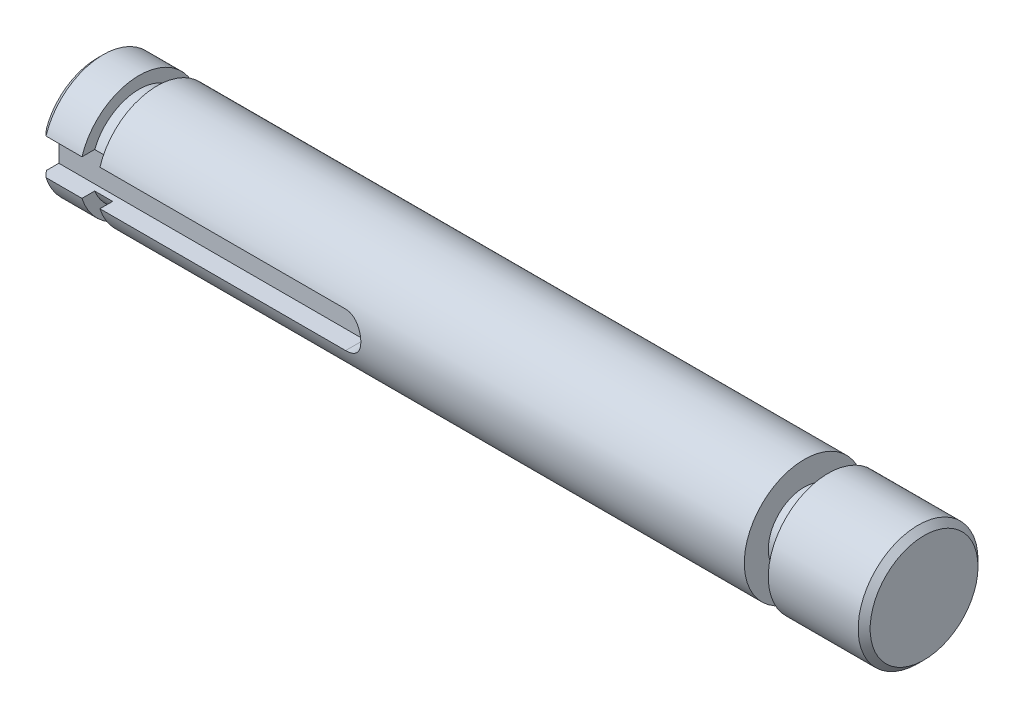
ISO-10303-21;
HEADER;
FILE_DESCRIPTION(('STEP AP214'),'2;1');
FILE_NAME('part.step','',(''),(''),'','','');
FILE_SCHEMA(('AUTOMOTIVE_DESIGN { 1 0 10303 214 1 1 1 1 }'));
ENDSEC;
DATA;
#1=APPLICATION_CONTEXT('core data for automotive mechanical design processes');
#2=APPLICATION_PROTOCOL_DEFINITION('international standard','automotive_design',2000,#1);
#3=PRODUCT_CONTEXT('',#1,'mechanical');
#4=PRODUCT('Part','Part','',(#3));
#5=PRODUCT_RELATED_PRODUCT_CATEGORY('part','',(#4));
#6=PRODUCT_DEFINITION_FORMATION('','',#4);
#7=PRODUCT_DEFINITION_CONTEXT('part definition',#1,'design');
#8=PRODUCT_DEFINITION('design','',#6,#7);
#9=PRODUCT_DEFINITION_SHAPE('','',#8);
#10=(LENGTH_UNIT() NAMED_UNIT(*) SI_UNIT(.MILLI.,.METRE.));
#11=(NAMED_UNIT(*) PLANE_ANGLE_UNIT() SI_UNIT($,.RADIAN.));
#12=(NAMED_UNIT(*) SI_UNIT($,.STERADIAN.) SOLID_ANGLE_UNIT());
#13=UNCERTAINTY_MEASURE_WITH_UNIT(LENGTH_MEASURE(1.E-05),#10,'distance_accuracy_value','');
#14=(GEOMETRIC_REPRESENTATION_CONTEXT(3) GLOBAL_UNCERTAINTY_ASSIGNED_CONTEXT((#13)) GLOBAL_UNIT_ASSIGNED_CONTEXT((#10,
#11,#12)) REPRESENTATION_CONTEXT('',''));
#15=CARTESIAN_POINT('',(0.,0.,0.));
#16=DIRECTION('',(0.,0.,1.));
#17=DIRECTION('',(1.,0.,0.));
#18=AXIS2_PLACEMENT_3D('',#15,#16,#17);
#19=CARTESIAN_POINT('',(34.5,0.,0.));
#20=DIRECTION('',(-1.,0.,0.));
#21=DIRECTION('',(0.,0.,1.));
#22=AXIS2_PLACEMENT_3D('',#19,#20,#21);
#23=CYLINDRICAL_SURFACE('',#22,5.);
#24=CARTESIAN_POINT('',(24.5,0.,0.));
#25=DIRECTION('',(1.,0.,0.));
#26=DIRECTION('',(0.,0.,-1.));
#27=AXIS2_PLACEMENT_3D('',#24,#25,#26);
#28=CIRCLE('',#27,5.);
#29=CARTESIAN_POINT('',(24.5,0.,-5.));
#30=VERTEX_POINT('',#29);
#31=EDGE_CURVE('E180',#30,#30,#28,.T.);
#32=ORIENTED_EDGE('',*,*,#31,.F.);
#33=EDGE_LOOP('',(#32));
#34=FACE_BOUND('',#33,.T.);
#35=DIRECTION('',(-1.,0.,0.));
#36=VECTOR('',#35,1.);
#37=CARTESIAN_POINT('',(34.5,-1.5,4.76969600708473));
#38=LINE('',#37,#36);
#39=CARTESIAN_POINT('',(-29.5,-1.5,4.76969600708473));
#40=VERTEX_POINT('',#39);
#41=CARTESIAN_POINT('',(-9.00000000000001,-1.5,4.76969600708473));
#42=VERTEX_POINT('',#41);
#43=EDGE_CURVE('E162',#40,#42,#38,.F.);
#44=ORIENTED_EDGE('',*,*,#43,.F.);
#45=CARTESIAN_POINT('',(-29.5,0.,0.));
#46=DIRECTION('',(-1.,0.,0.));
#47=DIRECTION('',(0.,0.,1.));
#48=AXIS2_PLACEMENT_3D('',#45,#46,#47);
#49=CIRCLE('',#48,5.);
#50=CARTESIAN_POINT('',(-29.5,1.5,4.76969600708473));
#51=VERTEX_POINT('',#50);
#52=EDGE_CURVE('E168',#51,#40,#49,.T.);
#53=ORIENTED_EDGE('',*,*,#52,.F.);
#54=DIRECTION('',(-1.,0.,0.));
#55=VECTOR('',#54,1.);
#56=CARTESIAN_POINT('',(34.5,1.5,4.76969600708473));
#57=LINE('',#56,#55);
#58=CARTESIAN_POINT('',(-9.00000000000001,1.5,4.76969600708473));
#59=VERTEX_POINT('',#58);
#60=EDGE_CURVE('E153',#59,#51,#57,.T.);
#61=ORIENTED_EDGE('',*,*,#60,.F.);
#62=CARTESIAN_POINT('',(-9.00000000000001,-1.5,4.76969600708473));
#63=CARTESIAN_POINT('',(-8.95882060709199,-1.50000085357071,4.76969249084934));
#64=CARTESIAN_POINT('',(-8.91766195687388,-1.49830317083428,4.77022997000129));
#65=CARTESIAN_POINT('',(-8.83565883790444,-1.49153785660317,4.77235095109999));
#66=CARTESIAN_POINT('',(-8.79481430060511,-1.48647098275841,4.77393421787376));
#67=CARTESIAN_POINT('',(-8.67340945904534,-1.46630203689311,4.78018490618873));
#68=CARTESIAN_POINT('',(-8.59369360958363,-1.44623120413662,4.78635370384275));
#69=CARTESIAN_POINT('',(-8.43896442161414,-1.39353102315626,4.80195952113208));
#70=CARTESIAN_POINT('',(-8.36394944780192,-1.36090607068203,4.81139539670393));
#71=CARTESIAN_POINT('',(-8.22040331840241,-1.28407841117655,4.83246571212052));
#72=CARTESIAN_POINT('',(-8.15187520027157,-1.23987031651226,4.84410117434933));
#73=CARTESIAN_POINT('',(-8.02113394400295,-1.13964850658326,4.86866835244721));
#74=CARTESIAN_POINT('',(-7.95915633965661,-1.08333433465208,4.88162755412974));
#75=CARTESIAN_POINT('',(-7.84536441610004,-0.961138919873354,4.90714811559049));
#76=CARTESIAN_POINT('',(-7.79355181399695,-0.895256063916348,4.91970940785249));
#77=CARTESIAN_POINT('',(-7.70053622968151,-0.75410992131543,4.94333239727705));
#78=CARTESIAN_POINT('',(-7.65957481970205,-0.678680819336259,4.95435770971354));
#79=CARTESIAN_POINT('',(-7.59101158838185,-0.521621185505775,4.97334469846208));
#80=CARTESIAN_POINT('',(-7.56340632220573,-0.439992259012928,4.98130716463903));
#81=CARTESIAN_POINT('',(-7.52312020089796,-0.275324697874879,4.99307639935002));
#82=CARTESIAN_POINT('',(-7.51003514203026,-0.192393125294255,4.99699549276993));
#83=CARTESIAN_POINT('',(-7.49788265863674,-0.0254235719980831,5.00063202022426));
#84=CARTESIAN_POINT('',(-7.49881258029984,0.0586141962423611,5.00035024971471));
#85=CARTESIAN_POINT('',(-7.514392908759,0.222571599946016,4.99569602566267));
#86=CARTESIAN_POINT('',(-7.52860534497872,0.30253714546464,4.99145415509187));
#87=CARTESIAN_POINT('',(-7.56963163523811,0.458890052102024,4.9795151369998));
#88=CARTESIAN_POINT('',(-7.59644614945594,0.535277225531996,4.97181780846028));
#89=CARTESIAN_POINT('',(-7.66221222164644,0.683347815892215,4.95365214926145));
#90=CARTESIAN_POINT('',(-7.70130164435695,0.754966006044141,4.94315255692525));
#91=CARTESIAN_POINT('',(-7.79039859004832,0.890765529574419,4.92049624651755));
#92=CARTESIAN_POINT('',(-7.84040855947884,0.954945191614594,4.90833915735884));
#93=CARTESIAN_POINT('',(-7.95219198808351,1.07665450541275,4.88311673571409));
#94=CARTESIAN_POINT('',(-8.01434386376075,1.13383351478034,4.87003445449554));
#95=CARTESIAN_POINT('',(-8.14749742342792,1.23706769492487,4.84484215114658));
#96=CARTESIAN_POINT('',(-8.21850168036553,1.28311962013078,4.83273241337565));
#97=CARTESIAN_POINT('',(-8.36828092844929,1.36316407240863,4.81077228795653));
#98=CARTESIAN_POINT('',(-8.44712717959341,1.39703006341134,4.80094596245948));
#99=CARTESIAN_POINT('',(-8.60972450398175,1.45085886004699,4.78495663653201));
#100=CARTESIAN_POINT('',(-8.69346786071438,1.47084293218035,4.77878803475875));
#101=CARTESIAN_POINT('',(-8.81499488907019,1.4890120359008,4.77314032325006));
#102=CARTESIAN_POINT('',(-8.85189073417961,1.49313202989009,4.77185156275267));
#103=CARTESIAN_POINT('',(-8.92585147909953,1.49862355614854,4.77012928611782));
#104=CARTESIAN_POINT('',(-8.96291604966386,1.49999912968269,4.76969451246644));
#105=CARTESIAN_POINT('',(-9.00000000000001,1.5,4.76969600708473));
#106=B_SPLINE_CURVE_WITH_KNOTS('',3,(#62,#63,#64,#65,#66,#67,#68,#69,#70,#71,#72,#73,#74,#75,
#76,#77,#78,#79,#80,#81,#82,#83,#84,#85,#86,#87,#88,#89,#90,#91,#92,#93,#94,#95,#96,#97,#98,#99,
#100,#101,#102,#103,#104,#105),.UNSPECIFIED.,.F.,.F.,(4,2,2,2,2,2,2,2,2,2,2,2,2,2,2,2,2,2,2,2,2,
4),(0.,0.123459071219734,0.246890388853042,0.49291134961521,0.738846245884323,0.984895736828092,
1.23795510798803,1.49105719006936,1.74939356197455,2.00766326783256,2.25854751319802,
2.5093842528947,2.75223130012966,2.99509107067835,3.2407824256273,3.48652887757005,
3.74172568310981,3.99699683536777,4.25484698071527,4.51230123440207,4.62365084745808,
4.73483637253615),.UNSPECIFIED.);
#107=EDGE_CURVE('E11',#42,#59,#106,.T.);
#108=ORIENTED_EDGE('',*,*,#107,.F.);
#109=EDGE_LOOP('',(#44,#53,#61,#108));
#110=FACE_BOUND('',#109,.T.);
#111=ADVANCED_FACE('F38',(#34,#110),#23,.T.);
#112=CARTESIAN_POINT('',(-31.,0.,0.));
#113=DIRECTION('',(-1.,0.,0.));
#114=DIRECTION('',(0.,0.,1.));
#115=AXIS2_PLACEMENT_3D('',#112,#113,#114);
#116=PLANE('',#115);
#117=DIRECTION('',(0.,0.,-1.));
#118=VECTOR('',#117,1.);
#119=CARTESIAN_POINT('',(-31.,-1.5,0.));
#120=LINE('',#119,#118);
#121=CARTESIAN_POINT('',(-31.,-1.5,4.76969600708473));
#122=VERTEX_POINT('',#121);
#123=CARTESIAN_POINT('',(-31.,-1.5,3.70809924354783));
#124=VERTEX_POINT('',#123);
#125=EDGE_CURVE('E157',#122,#124,#120,.T.);
#126=ORIENTED_EDGE('',*,*,#125,.F.);
#127=CARTESIAN_POINT('',(-31.,0.,0.));
#128=DIRECTION('',(-1.,0.,0.));
#129=DIRECTION('',(0.,0.,1.));
#130=AXIS2_PLACEMENT_3D('',#127,#128,#129);
#131=CIRCLE('',#130,5.);
#132=CARTESIAN_POINT('',(-31.,1.5,4.76969600708473));
#133=VERTEX_POINT('',#132);
#134=EDGE_CURVE('E171',#133,#122,#131,.T.);
#135=ORIENTED_EDGE('',*,*,#134,.F.);
#136=DIRECTION('',(0.,0.,1.));
#137=VECTOR('',#136,1.);
#138=CARTESIAN_POINT('',(-31.,1.5,0.));
#139=LINE('',#138,#137);
#140=CARTESIAN_POINT('',(-31.,1.5,3.70809924354783));
#141=VERTEX_POINT('',#140);
#142=EDGE_CURVE('E141',#141,#133,#139,.T.);
#143=ORIENTED_EDGE('',*,*,#142,.F.);
#144=CARTESIAN_POINT('',(-31.,0.,0.));
#145=DIRECTION('',(-1.,0.,0.));
#146=DIRECTION('',(0.,0.,1.));
#147=AXIS2_PLACEMENT_3D('',#144,#145,#146);
#148=CIRCLE('',#147,4.);
#149=EDGE_CURVE('E165',#141,#124,#148,.T.);
#150=ORIENTED_EDGE('',*,*,#149,.T.);
#151=EDGE_LOOP('',(#126,#135,#143,#150));
#152=FACE_BOUND('',#151,.T.);
#153=ADVANCED_FACE('F226',(#152),#116,.F.);
#154=CARTESIAN_POINT('',(-29.5,0.,0.));
#155=DIRECTION('',(-1.,0.,0.));
#156=DIRECTION('',(0.,0.,1.));
#157=AXIS2_PLACEMENT_3D('',#154,#155,#156);
#158=PLANE('',#157);
#159=ORIENTED_EDGE('',*,*,#52,.T.);
#160=DIRECTION('',(0.,0.,-1.));
#161=VECTOR('',#160,1.);
#162=CARTESIAN_POINT('',(-29.5,-1.5,0.));
#163=LINE('',#162,#161);
#164=CARTESIAN_POINT('',(-29.5,-1.5,3.70809924354783));
#165=VERTEX_POINT('',#164);
#166=EDGE_CURVE('E68',#40,#165,#163,.T.);
#167=ORIENTED_EDGE('',*,*,#166,.T.);
#168=CARTESIAN_POINT('',(-29.5,0.,0.));
#169=DIRECTION('',(-1.,0.,0.));
#170=DIRECTION('',(0.,0.,1.));
#171=AXIS2_PLACEMENT_3D('',#168,#169,#170);
#172=CIRCLE('',#171,4.);
#173=CARTESIAN_POINT('',(-29.5,1.5,3.70809924354783));
#174=VERTEX_POINT('',#173);
#175=EDGE_CURVE('E164',#174,#165,#172,.T.);
#176=ORIENTED_EDGE('',*,*,#175,.F.);
#177=DIRECTION('',(0.,0.,1.));
#178=VECTOR('',#177,1.);
#179=CARTESIAN_POINT('',(-29.5,1.5,0.));
#180=LINE('',#179,#178);
#181=EDGE_CURVE('E150',#174,#51,#180,.T.);
#182=ORIENTED_EDGE('',*,*,#181,.T.);
#183=EDGE_LOOP('',(#159,#167,#176,#182));
#184=FACE_BOUND('',#183,.T.);
#185=ADVANCED_FACE('F224',(#184),#158,.T.);
#186=CARTESIAN_POINT('',(-31.,0.,0.));
#187=DIRECTION('',(1.,0.,0.));
#188=DIRECTION('',(0.,0.,-1.));
#189=AXIS2_PLACEMENT_3D('',#186,#187,#188);
#190=CYLINDRICAL_SURFACE('',#189,4.);
#191=DIRECTION('',(1.,0.,0.));
#192=VECTOR('',#191,1.);
#193=CARTESIAN_POINT('',(-31.,-1.5,3.70809924354783));
#194=LINE('',#193,#192);
#195=EDGE_CURVE('E159',#124,#165,#194,.T.);
#196=ORIENTED_EDGE('',*,*,#195,.F.);
#197=ORIENTED_EDGE('',*,*,#149,.F.);
#198=DIRECTION('',(1.,0.,0.));
#199=VECTOR('',#198,1.);
#200=CARTESIAN_POINT('',(-31.,1.5,3.70809924354783));
#201=LINE('',#200,#199);
#202=EDGE_CURVE('E148',#174,#141,#201,.F.);
#203=ORIENTED_EDGE('',*,*,#202,.F.);
#204=ORIENTED_EDGE('',*,*,#175,.T.);
#205=EDGE_LOOP('',(#196,#197,#203,#204));
#206=FACE_BOUND('',#205,.T.);
#207=ADVANCED_FACE('F221',(#206),#190,.T.);
#208=CARTESIAN_POINT('',(-34.5,0.,0.));
#209=DIRECTION('',(1.,0.,0.));
#210=DIRECTION('',(0.,0.,-1.));
#211=AXIS2_PLACEMENT_3D('',#208,#209,#210);
#212=PLANE('',#211);
#213=DIRECTION('',(0.,0.,-1.));
#214=VECTOR('',#213,1.);
#215=CARTESIAN_POINT('',(-34.5,-1.5,5.));
#216=LINE('',#215,#214);
#217=CARTESIAN_POINT('',(-34.5,-1.5,4.24264068711928));
#218=VERTEX_POINT('',#217);
#219=CARTESIAN_POINT('',(-34.5,-1.5,3.2));
#220=VERTEX_POINT('',#219);
#221=EDGE_CURVE('E118',#218,#220,#216,.T.);
#222=ORIENTED_EDGE('',*,*,#221,.T.);
#223=DIRECTION('',(0.,-1.,0.));
#224=VECTOR('',#223,1.);
#225=CARTESIAN_POINT('',(-34.5,1.5,3.2));
#226=LINE('',#225,#224);
#227=CARTESIAN_POINT('',(-34.5,1.5,3.2));
#228=VERTEX_POINT('',#227);
#229=EDGE_CURVE('E126',#228,#220,#226,.T.);
#230=ORIENTED_EDGE('',*,*,#229,.F.);
#231=DIRECTION('',(0.,0.,-1.));
#232=VECTOR('',#231,1.);
#233=CARTESIAN_POINT('',(-34.5,1.5,5.));
#234=LINE('',#233,#232);
#235=CARTESIAN_POINT('',(-34.5,1.5,4.24264068711928));
#236=VERTEX_POINT('',#235);
#237=EDGE_CURVE('E277',#236,#228,#234,.T.);
#238=ORIENTED_EDGE('',*,*,#237,.F.);
#239=CARTESIAN_POINT('',(-34.5,0.,0.));
#240=DIRECTION('',(1.,0.,0.));
#241=DIRECTION('',(0.,0.,-1.));
#242=AXIS2_PLACEMENT_3D('',#239,#240,#241);
#243=CIRCLE('',#242,4.5);
#244=EDGE_CURVE('E139',#236,#218,#243,.F.);
#245=ORIENTED_EDGE('',*,*,#244,.T.);
#246=EDGE_LOOP('',(#222,#230,#238,#245));
#247=FACE_BOUND('',#246,.T.);
#248=ADVANCED_FACE('F137',(#247),#212,.F.);
#249=DIRECTION('',(-1.,0.,0.));
#250=VECTOR('',#249,1.);
#251=CARTESIAN_POINT('',(34.5,-1.5,4.76969600708473));
#252=LINE('',#251,#250);
#253=CARTESIAN_POINT('',(-34.,-1.5,4.76969600708473));
#254=VERTEX_POINT('',#253);
#255=EDGE_CURVE('E155',#254,#122,#252,.F.);
#256=ORIENTED_EDGE('',*,*,#255,.F.);
#257=CARTESIAN_POINT('',(-34.,0.,0.));
#258=DIRECTION('',(1.,0.,0.));
#259=DIRECTION('',(0.,0.,-1.));
#260=AXIS2_PLACEMENT_3D('',#257,#258,#259);
#261=CIRCLE('',#260,5.);
#262=CARTESIAN_POINT('',(-34.,1.5,4.76969600708473));
#263=VERTEX_POINT('',#262);
#264=EDGE_CURVE('E194',#254,#263,#261,.T.);
#265=ORIENTED_EDGE('',*,*,#264,.T.);
#266=DIRECTION('',(-1.,0.,0.));
#267=VECTOR('',#266,1.);
#268=CARTESIAN_POINT('',(34.5,1.5,4.76969600708473));
#269=LINE('',#268,#267);
#270=EDGE_CURVE('E60',#133,#263,#269,.T.);
#271=ORIENTED_EDGE('',*,*,#270,.F.);
#272=ORIENTED_EDGE('',*,*,#134,.T.);
#273=EDGE_LOOP('',(#256,#265,#271,#272));
#274=FACE_BOUND('',#273,.T.);
#275=ADVANCED_FACE('F251',(#274),#23,.T.);
#276=CARTESIAN_POINT('',(-34.,0.,0.));
#277=DIRECTION('',(1.,0.,0.));
#278=DIRECTION('',(0.,0.,-1.));
#279=AXIS2_PLACEMENT_3D('',#276,#277,#278);
#280=CONICAL_SURFACE('',#279,5.,0.78539816339745);
#281=ORIENTED_EDGE('',*,*,#264,.F.);
#282=CARTESIAN_POINT('',(-31.8609473171126,-1.5,6.97969005107261));
#283=CARTESIAN_POINT('',(-32.0690052900893,-1.5,6.76685846964305));
#284=CARTESIAN_POINT('',(-32.2768708615187,-1.5,6.55383788587081));
#285=CARTESIAN_POINT('',(-32.6920123009123,-1.5,6.12725063306096));
#286=CARTESIAN_POINT('',(-32.8992882071887,-1.5,5.91368400129659));
#287=CARTESIAN_POINT('',(-33.3129705368911,-1.5,5.48591440945266));
#288=CARTESIAN_POINT('',(-33.519377340571,-1.5,5.27171181751179));
#289=CARTESIAN_POINT('',(-33.9311150771752,-1.5,4.84224439352638));
#290=CARTESIAN_POINT('',(-34.1364459303664,-1.5,4.62697948499158));
#291=CARTESIAN_POINT('',(-34.5456625222699,-1.5,4.19476087473618));
#292=CARTESIAN_POINT('',(-34.7495470263421,-1.5,3.97780600015098));
#293=CARTESIAN_POINT('',(-35.0534378048551,-1.5,3.65061096884926));
#294=CARTESIAN_POINT('',(-35.1544031148046,-1.5,3.54126204128286));
#295=CARTESIAN_POINT('',(-35.3555012481673,-1.5,3.32179359398855));
#296=CARTESIAN_POINT('',(-35.4556340444719,-1.5,3.21167404938082));
#297=CARTESIAN_POINT('',(-35.6548638106812,-1.5,2.99036108474282));
#298=CARTESIAN_POINT('',(-35.7539600067692,-1.5,2.87916696721389));
#299=CARTESIAN_POINT('',(-35.9506379072296,-1.5,2.6554592565589));
#300=CARTESIAN_POINT('',(-36.0482197474772,-1.5,2.54294578342071));
#301=CARTESIAN_POINT('',(-36.1930149701006,-1.5,2.37277183064053));
#302=CARTESIAN_POINT('',(-36.2410318728437,-1.5,2.31579520626767));
#303=CARTESIAN_POINT('',(-36.336410412246,-1.5,2.20129812592812));
#304=CARTESIAN_POINT('',(-36.3837720671063,-1.5,2.14377768514221));
#305=CARTESIAN_POINT('',(-36.4777140489333,-1.5,2.02807141801446));
#306=CARTESIAN_POINT('',(-36.5242941352244,-1.5,1.96988539566466));
#307=CARTESIAN_POINT('',(-36.6164558953132,-1.5,1.85271977151891));
#308=CARTESIAN_POINT('',(-36.6620374724692,-1.5,1.7937400937922));
#309=CARTESIAN_POINT('',(-36.7070140779739,-1.5,1.73429652557169));
#310=B_SPLINE_CURVE_WITH_KNOTS('',3,(#282,#283,#284,#285,#286,#287,#288,#289,#290,#291,#292,
#293,#294,#295,#296,#297,#298,#299,#300,#301,#302,#303,#304,#305,#306,#307,#308,#309),
.UNSPECIFIED.,.F.,.F.,(4,2,2,2,2,2,2,2,2,2,2,2,2,4),(0.,0.89289983798289,1.78574027241742,
2.67813788006185,3.5706007090967,4.46375081632204,4.91024592323062,5.35675551262279,
5.80357753465277,6.25035923115378,6.47388976350276,6.69741407425855,6.92100599838937,
7.1446194683247),.UNSPECIFIED.);
#311=EDGE_CURVE('E53',#254,#218,#310,.T.);
#312=ORIENTED_EDGE('',*,*,#311,.T.);
#313=ORIENTED_EDGE('',*,*,#244,.F.);
#314=CARTESIAN_POINT('',(-36.7070140779739,1.5,1.73429652557169));
#315=CARTESIAN_POINT('',(-36.6731320660261,1.5,1.77908693888236));
#316=CARTESIAN_POINT('',(-36.638900551902,1.5,1.82361036804484));
#317=CARTESIAN_POINT('',(-36.5698385854765,1.5,1.91218682312016));
#318=CARTESIAN_POINT('',(-36.535008164866,1.5,1.9562398737242));
#319=CARTESIAN_POINT('',(-36.429777402497,1.5,2.0877780850195));
#320=CARTESIAN_POINT('',(-36.3586237662692,1.5,2.17466038152806));
#321=CARTESIAN_POINT('',(-36.2148824831828,1.5,2.34715722091075));
#322=CARTESIAN_POINT('',(-36.142295508272,1.5,2.43277232638573));
#323=CARTESIAN_POINT('',(-35.9960055754008,1.5,2.60305076304625));
#324=CARTESIAN_POINT('',(-35.922302551641,1.5,2.6877140375974));
#325=CARTESIAN_POINT('',(-35.7000248776767,1.5,2.94046166043097));
#326=CARTESIAN_POINT('',(-35.5501783529503,1.5,3.10742612228458));
#327=CARTESIAN_POINT('',(-35.2483420576352,1.5,3.43942871545458));
#328=CARTESIAN_POINT('',(-35.0963520574344,1.5,3.60446663688282));
#329=CARTESIAN_POINT('',(-34.8936868957398,1.5,3.82259025149471));
#330=CARTESIAN_POINT('',(-34.8436588755591,1.5,3.87627856474982));
#331=CARTESIAN_POINT('',(-34.7434647717696,1.5,3.98352350180323));
#332=CARTESIAN_POINT('',(-34.6932986919759,1.5,4.03708012916458));
#333=CARTESIAN_POINT('',(-34.542603266947,1.5,4.19758760920788));
#334=CARTESIAN_POINT('',(-34.4418880268484,1.5,4.30436392171742));
#335=CARTESIAN_POINT('',(-34.1363681367456,1.5,4.62707098042187));
#336=CARTESIAN_POINT('',(-33.9309496354163,1.5,4.84242035233032));
#337=CARTESIAN_POINT('',(-33.5190245458365,1.5,5.27207641108813));
#338=CARTESIAN_POINT('',(-33.3125179511522,1.5,5.48638309175751));
#339=CARTESIAN_POINT('',(-32.898818107301,1.5,5.91416941738405));
#340=CARTESIAN_POINT('',(-32.6916251594587,1.5,6.12764935393667));
#341=CARTESIAN_POINT('',(-32.2766677830417,1.5,6.5540456763219));
#342=CARTESIAN_POINT('',(-32.0689033649537,1.5,6.76696207235696));
#343=CARTESIAN_POINT('',(-31.8609473171126,1.5,6.97969005107261));
#344=B_SPLINE_CURVE_WITH_KNOTS('',3,(#314,#315,#316,#317,#318,#319,#320,#321,#322,#323,#324,
#325,#326,#327,#328,#329,#330,#331,#332,#333,#334,#335,#336,#337,#338,#339,#340,#341,#342,#343),
.UNSPECIFIED.,.F.,.F.,(4,2,2,2,2,2,2,2,2,2,2,2,2,2,4),(0.,0.168481178560409,0.336953469263773,
0.673829854894279,1.01055189600276,1.34729386731285,2.02029767349438,2.69337412875385,
2.91352652434992,3.13367289622909,3.57401537215846,4.46684087004097,5.35967165323347,
6.25215200141002,7.14461607990619),.UNSPECIFIED.);
#345=EDGE_CURVE('E198',#236,#263,#344,.T.);
#346=ORIENTED_EDGE('',*,*,#345,.T.);
#347=EDGE_LOOP('',(#281,#312,#313,#346));
#348=FACE_BOUND('',#347,.T.);
#349=ADVANCED_FACE('F40',(#348),#280,.T.);
#350=CARTESIAN_POINT('',(34.,0.,0.));
#351=DIRECTION('',(1.,0.,0.));
#352=DIRECTION('',(0.,0.,-1.));
#353=AXIS2_PLACEMENT_3D('',#350,#351,#352);
#354=CIRCLE('',#353,5.);
#355=CARTESIAN_POINT('',(34.,0.,-5.));
#356=VERTEX_POINT('',#355);
#357=EDGE_CURVE('E191',#356,#356,#354,.F.);
#358=ORIENTED_EDGE('',*,*,#357,.T.);
#359=EDGE_LOOP('',(#358));
#360=FACE_BOUND('',#359,.T.);
#361=CARTESIAN_POINT('',(26.5,0.,0.));
#362=DIRECTION('',(1.,0.,0.));
#363=DIRECTION('',(0.,0.,-1.));
#364=AXIS2_PLACEMENT_3D('',#361,#362,#363);
#365=CIRCLE('',#364,5.);
#366=CARTESIAN_POINT('',(26.5,0.,-5.));
#367=VERTEX_POINT('',#366);
#368=EDGE_CURVE('E183',#367,#367,#365,.T.);
#369=ORIENTED_EDGE('',*,*,#368,.T.);
#370=EDGE_LOOP('',(#369));
#371=FACE_BOUND('',#370,.T.);
#372=ADVANCED_FACE('F248',(#360,#371),#23,.T.);
#373=CARTESIAN_POINT('',(34.5,0.,0.));
#374=DIRECTION('',(1.,0.,0.));
#375=DIRECTION('',(0.,0.,-1.));
#376=AXIS2_PLACEMENT_3D('',#373,#374,#375);
#377=PLANE('',#376);
#378=CARTESIAN_POINT('',(34.5,0.,0.));
#379=DIRECTION('',(1.,0.,0.));
#380=DIRECTION('',(0.,0.,-1.));
#381=AXIS2_PLACEMENT_3D('',#378,#379,#380);
#382=CIRCLE('',#381,4.50000000000002);
#383=CARTESIAN_POINT('',(34.5,0.,-4.50000000000002));
#384=VERTEX_POINT('',#383);
#385=EDGE_CURVE('E186',#384,#384,#382,.T.);
#386=ORIENTED_EDGE('',*,*,#385,.T.);
#387=EDGE_LOOP('',(#386));
#388=FACE_BOUND('',#387,.T.);
#389=ADVANCED_FACE('F241',(#388),#377,.T.);
#390=CARTESIAN_POINT('',(26.5,0.,0.));
#391=DIRECTION('',(1.,0.,0.));
#392=DIRECTION('',(0.,0.,-1.));
#393=AXIS2_PLACEMENT_3D('',#390,#391,#392);
#394=PLANE('',#393);
#395=ORIENTED_EDGE('',*,*,#368,.F.);
#396=EDGE_LOOP('',(#395));
#397=FACE_BOUND('',#396,.T.);
#398=CARTESIAN_POINT('',(26.5,0.,0.));
#399=DIRECTION('',(1.,0.,0.));
#400=DIRECTION('',(0.,0.,-1.));
#401=AXIS2_PLACEMENT_3D('',#398,#399,#400);
#402=CIRCLE('',#401,3.);
#403=CARTESIAN_POINT('',(26.5,0.,-3.));
#404=VERTEX_POINT('',#403);
#405=EDGE_CURVE('E177',#404,#404,#402,.T.);
#406=ORIENTED_EDGE('',*,*,#405,.T.);
#407=EDGE_LOOP('',(#406));
#408=FACE_BOUND('',#407,.T.);
#409=ADVANCED_FACE('F238',(#397,#408),#394,.F.);
#410=CARTESIAN_POINT('',(24.5,0.,0.));
#411=DIRECTION('',(1.,0.,0.));
#412=DIRECTION('',(0.,0.,-1.));
#413=AXIS2_PLACEMENT_3D('',#410,#411,#412);
#414=PLANE('',#413);
#415=ORIENTED_EDGE('',*,*,#31,.T.);
#416=EDGE_LOOP('',(#415));
#417=FACE_BOUND('',#416,.T.);
#418=CARTESIAN_POINT('',(24.5,0.,0.));
#419=DIRECTION('',(1.,0.,0.));
#420=DIRECTION('',(0.,0.,-1.));
#421=AXIS2_PLACEMENT_3D('',#418,#419,#420);
#422=CIRCLE('',#421,3.);
#423=CARTESIAN_POINT('',(24.5,0.,-3.));
#424=VERTEX_POINT('',#423);
#425=EDGE_CURVE('E174',#424,#424,#422,.T.);
#426=ORIENTED_EDGE('',*,*,#425,.F.);
#427=EDGE_LOOP('',(#426));
#428=FACE_BOUND('',#427,.T.);
#429=ADVANCED_FACE('F236',(#417,#428),#414,.T.);
#430=CARTESIAN_POINT('',(26.5,0.,0.));
#431=DIRECTION('',(-1.,0.,0.));
#432=DIRECTION('',(0.,0.,1.));
#433=AXIS2_PLACEMENT_3D('',#430,#431,#432);
#434=CYLINDRICAL_SURFACE('',#433,3.);
#435=ORIENTED_EDGE('',*,*,#405,.F.);
#436=EDGE_LOOP('',(#435));
#437=FACE_BOUND('',#436,.T.);
#438=ORIENTED_EDGE('',*,*,#425,.T.);
#439=EDGE_LOOP('',(#438));
#440=FACE_BOUND('',#439,.T.);
#441=ADVANCED_FACE('F233',(#437,#440),#434,.T.);
#442=CARTESIAN_POINT('',(34.5,0.,0.));
#443=DIRECTION('',(-1.,0.,0.));
#444=DIRECTION('',(0.,0.,1.));
#445=AXIS2_PLACEMENT_3D('',#442,#443,#444);
#446=CONICAL_SURFACE('',#445,4.50000000000002,0.785398163397443);
#447=ORIENTED_EDGE('',*,*,#357,.F.);
#448=EDGE_LOOP('',(#447));
#449=FACE_BOUND('',#448,.T.);
#450=ORIENTED_EDGE('',*,*,#385,.F.);
#451=EDGE_LOOP('',(#450));
#452=FACE_BOUND('',#451,.T.);
#453=ADVANCED_FACE('F216',(#449,#452),#446,.T.);
#454=CARTESIAN_POINT('',(-9.00000000000001,0.,5.));
#455=DIRECTION('',(0.,0.,-1.));
#456=DIRECTION('',(-1.,0.,0.));
#457=AXIS2_PLACEMENT_3D('',#454,#455,#456);
#458=CYLINDRICAL_SURFACE('',#457,1.5);
#459=DIRECTION('',(0.,0.,-1.));
#460=VECTOR('',#459,1.);
#461=CARTESIAN_POINT('',(-9.00000000000001,-1.5,5.));
#462=LINE('',#461,#460);
#463=CARTESIAN_POINT('',(-9.00000000000001,-1.5,3.2));
#464=VERTEX_POINT('',#463);
#465=EDGE_CURVE('E121',#42,#464,#462,.T.);
#466=ORIENTED_EDGE('',*,*,#465,.F.);
#467=ORIENTED_EDGE('',*,*,#107,.T.);
#468=DIRECTION('',(0.,0.,-1.));
#469=VECTOR('',#468,1.);
#470=CARTESIAN_POINT('',(-9.00000000000001,1.5,5.));
#471=LINE('',#470,#469);
#472=CARTESIAN_POINT('',(-9.00000000000001,1.5,3.2));
#473=VERTEX_POINT('',#472);
#474=EDGE_CURVE('E143',#59,#473,#471,.T.);
#475=ORIENTED_EDGE('',*,*,#474,.T.);
#476=CARTESIAN_POINT('',(-9.00000000000001,0.,3.2));
#477=DIRECTION('',(0.,0.,1.));
#478=DIRECTION('',(1.,0.,0.));
#479=AXIS2_PLACEMENT_3D('',#476,#477,#478);
#480=CIRCLE('',#479,1.5);
#481=EDGE_CURVE('E125',#464,#473,#480,.T.);
#482=ORIENTED_EDGE('',*,*,#481,.F.);
#483=EDGE_LOOP('',(#466,#467,#475,#482));
#484=FACE_BOUND('',#483,.T.);
#485=ADVANCED_FACE('F213',(#484),#458,.F.);
#486=CARTESIAN_POINT('',(-34.5,-1.5,5.));
#487=DIRECTION('',(0.,1.,0.));
#488=DIRECTION('',(0.,0.,1.));
#489=AXIS2_PLACEMENT_3D('',#486,#487,#488);
#490=PLANE('',#489);
#491=ORIENTED_EDGE('',*,*,#43,.T.);
#492=ORIENTED_EDGE('',*,*,#465,.T.);
#493=DIRECTION('',(1.,0.,0.));
#494=VECTOR('',#493,1.);
#495=CARTESIAN_POINT('',(-34.5,-1.5,3.2));
#496=LINE('',#495,#494);
#497=EDGE_CURVE('E114',#220,#464,#496,.T.);
#498=ORIENTED_EDGE('',*,*,#497,.F.);
#499=ORIENTED_EDGE('',*,*,#221,.F.);
#500=ORIENTED_EDGE('',*,*,#311,.F.);
#501=ORIENTED_EDGE('',*,*,#255,.T.);
#502=ORIENTED_EDGE('',*,*,#125,.T.);
#503=ORIENTED_EDGE('',*,*,#195,.T.);
#504=ORIENTED_EDGE('',*,*,#166,.F.);
#505=EDGE_LOOP('',(#491,#492,#498,#499,#500,#501,#502,#503,#504));
#506=FACE_BOUND('',#505,.T.);
#507=ADVANCED_FACE('F116',(#506),#490,.T.);
#508=CARTESIAN_POINT('',(-34.5,1.5,5.));
#509=DIRECTION('',(0.,-1.,0.));
#510=DIRECTION('',(0.,0.,-1.));
#511=AXIS2_PLACEMENT_3D('',#508,#509,#510);
#512=PLANE('',#511);
#513=ORIENTED_EDGE('',*,*,#60,.T.);
#514=ORIENTED_EDGE('',*,*,#181,.F.);
#515=ORIENTED_EDGE('',*,*,#202,.T.);
#516=ORIENTED_EDGE('',*,*,#142,.T.);
#517=ORIENTED_EDGE('',*,*,#270,.T.);
#518=ORIENTED_EDGE('',*,*,#345,.F.);
#519=ORIENTED_EDGE('',*,*,#237,.T.);
#520=DIRECTION('',(-1.,0.,0.));
#521=VECTOR('',#520,1.);
#522=CARTESIAN_POINT('',(-34.5,1.5,3.2));
#523=LINE('',#522,#521);
#524=EDGE_CURVE('E132',#473,#228,#523,.T.);
#525=ORIENTED_EDGE('',*,*,#524,.F.);
#526=ORIENTED_EDGE('',*,*,#474,.F.);
#527=EDGE_LOOP('',(#513,#514,#515,#516,#517,#518,#519,#525,#526));
#528=FACE_BOUND('',#527,.T.);
#529=ADVANCED_FACE('F209',(#528),#512,.T.);
#530=CARTESIAN_POINT('',(-9.00000000000001,0.,3.2));
#531=DIRECTION('',(0.,0.,1.));
#532=DIRECTION('',(1.,0.,0.));
#533=AXIS2_PLACEMENT_3D('',#530,#531,#532);
#534=PLANE('',#533);
#535=ORIENTED_EDGE('',*,*,#229,.T.);
#536=ORIENTED_EDGE('',*,*,#497,.T.);
#537=ORIENTED_EDGE('',*,*,#481,.T.);
#538=ORIENTED_EDGE('',*,*,#524,.T.);
#539=EDGE_LOOP('',(#535,#536,#537,#538));
#540=FACE_BOUND('',#539,.T.);
#541=ADVANCED_FACE('F130',(#540),#534,.T.);
#542=CLOSED_SHELL('',(#111,#153,#185,#207,#248,#275,#349,#372,#389,#409,#429,#441,#453,#485,
#507,#529,#541));
#543=MANIFOLD_SOLID_BREP('B2',#542);
#544=ADVANCED_BREP_SHAPE_REPRESENTATION('',(#18,#543),#14);
#545=SHAPE_DEFINITION_REPRESENTATION(#9,#544);
ENDSEC;
END-ISO-10303-21;
